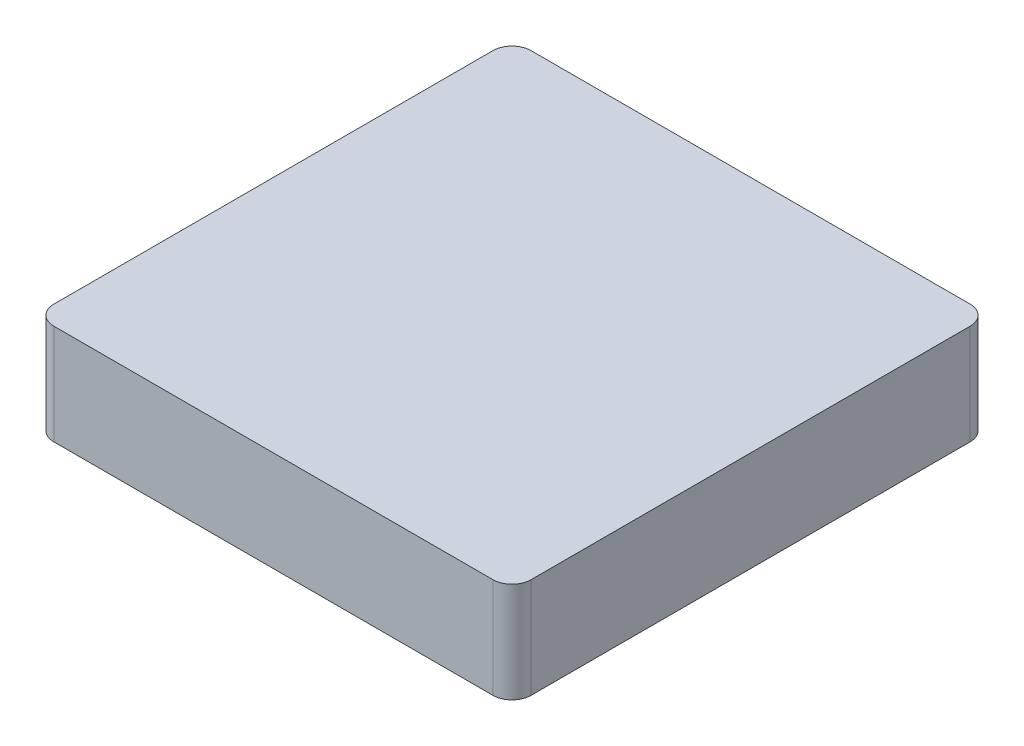
ISO-10303-21;
HEADER;
FILE_DESCRIPTION(('STEP AP214'),'2;1');
FILE_NAME('part.step','',(''),(''),'','','');
FILE_SCHEMA(('AUTOMOTIVE_DESIGN { 1 0 10303 214 1 1 1 1 }'));
ENDSEC;
DATA;
#1=APPLICATION_CONTEXT('core data for automotive mechanical design processes');
#2=APPLICATION_PROTOCOL_DEFINITION('international standard','automotive_design',2000,#1);
#3=PRODUCT_CONTEXT('',#1,'mechanical');
#4=PRODUCT('Part','Part','',(#3));
#5=PRODUCT_RELATED_PRODUCT_CATEGORY('part','',(#4));
#6=PRODUCT_DEFINITION_FORMATION('','',#4);
#7=PRODUCT_DEFINITION_CONTEXT('part definition',#1,'design');
#8=PRODUCT_DEFINITION('design','',#6,#7);
#9=PRODUCT_DEFINITION_SHAPE('','',#8);
#10=(LENGTH_UNIT() NAMED_UNIT(*) SI_UNIT(.MILLI.,.METRE.));
#11=(NAMED_UNIT(*) PLANE_ANGLE_UNIT() SI_UNIT($,.RADIAN.));
#12=(NAMED_UNIT(*) SI_UNIT($,.STERADIAN.) SOLID_ANGLE_UNIT());
#13=UNCERTAINTY_MEASURE_WITH_UNIT(LENGTH_MEASURE(1.E-05),#10,'distance_accuracy_value','');
#14=(GEOMETRIC_REPRESENTATION_CONTEXT(3) GLOBAL_UNCERTAINTY_ASSIGNED_CONTEXT((#13)) GLOBAL_UNIT_ASSIGNED_CONTEXT((#10,
#11,#12)) REPRESENTATION_CONTEXT('',''));
#15=CARTESIAN_POINT('',(0.,0.,0.));
#16=DIRECTION('',(0.,0.,1.));
#17=DIRECTION('',(1.,0.,0.));
#18=AXIS2_PLACEMENT_3D('',#15,#16,#17);
#19=CARTESIAN_POINT('',(25.,10.,-25.));
#20=DIRECTION('',(-1.,0.,0.));
#21=DIRECTION('',(0.,0.,1.));
#22=AXIS2_PLACEMENT_3D('',#19,#20,#21);
#23=PLANE('',#22);
#24=DIRECTION('',(0.,0.,-1.));
#25=VECTOR('',#24,1.);
#26=CARTESIAN_POINT('',(25.,0.,-25.));
#27=LINE('',#26,#25);
#28=CARTESIAN_POINT('',(25.,0.,23.));
#29=VERTEX_POINT('',#28);
#30=CARTESIAN_POINT('',(25.,0.,-23.));
#31=VERTEX_POINT('',#30);
#32=EDGE_CURVE('E133',#29,#31,#27,.T.);
#33=ORIENTED_EDGE('',*,*,#32,.T.);
#34=DIRECTION('',(0.,-1.,0.));
#35=VECTOR('',#34,1.);
#36=CARTESIAN_POINT('',(25.,10.,-23.));
#37=LINE('',#36,#35);
#38=CARTESIAN_POINT('',(25.,10.5,-23.));
#39=VERTEX_POINT('',#38);
#40=EDGE_CURVE('E111',#31,#39,#37,.F.);
#41=ORIENTED_EDGE('',*,*,#40,.T.);
#42=DIRECTION('',(0.,0.,-1.));
#43=VECTOR('',#42,1.);
#44=CARTESIAN_POINT('',(25.,10.5,-25.));
#45=LINE('',#44,#43);
#46=CARTESIAN_POINT('',(25.,10.5,23.));
#47=VERTEX_POINT('',#46);
#48=EDGE_CURVE('E179',#47,#39,#45,.T.);
#49=ORIENTED_EDGE('',*,*,#48,.F.);
#50=DIRECTION('',(0.,-1.,0.));
#51=VECTOR('',#50,1.);
#52=CARTESIAN_POINT('',(25.,10.,23.));
#53=LINE('',#52,#51);
#54=EDGE_CURVE('E116',#47,#29,#53,.T.);
#55=ORIENTED_EDGE('',*,*,#54,.T.);
#56=EDGE_LOOP('',(#33,#41,#49,#55));
#57=FACE_BOUND('',#56,.T.);
#58=ADVANCED_FACE('F40',(#57),#23,.F.);
#59=CARTESIAN_POINT('',(-25.,10.,-25.));
#60=DIRECTION('',(0.,0.,1.));
#61=DIRECTION('',(1.,0.,0.));
#62=AXIS2_PLACEMENT_3D('',#59,#60,#61);
#63=PLANE('',#62);
#64=DIRECTION('',(-1.,0.,0.));
#65=VECTOR('',#64,1.);
#66=CARTESIAN_POINT('',(-25.,10.5,-25.));
#67=LINE('',#66,#65);
#68=CARTESIAN_POINT('',(23.,10.5,-25.));
#69=VERTEX_POINT('',#68);
#70=CARTESIAN_POINT('',(-23.,10.5,-25.));
#71=VERTEX_POINT('',#70);
#72=EDGE_CURVE('E126',#69,#71,#67,.T.);
#73=ORIENTED_EDGE('',*,*,#72,.F.);
#74=DIRECTION('',(0.,-1.,0.));
#75=VECTOR('',#74,1.);
#76=CARTESIAN_POINT('',(23.,10.,-25.));
#77=LINE('',#76,#75);
#78=CARTESIAN_POINT('',(23.,0.,-25.));
#79=VERTEX_POINT('',#78);
#80=EDGE_CURVE('E110',#69,#79,#77,.T.);
#81=ORIENTED_EDGE('',*,*,#80,.T.);
#82=DIRECTION('',(-1.,0.,0.));
#83=VECTOR('',#82,1.);
#84=CARTESIAN_POINT('',(-25.,0.,-25.));
#85=LINE('',#84,#83);
#86=CARTESIAN_POINT('',(-23.,0.,-25.));
#87=VERTEX_POINT('',#86);
#88=EDGE_CURVE('E123',#79,#87,#85,.T.);
#89=ORIENTED_EDGE('',*,*,#88,.T.);
#90=DIRECTION('',(0.,-1.,0.));
#91=VECTOR('',#90,1.);
#92=CARTESIAN_POINT('',(-23.,10.,-25.));
#93=LINE('',#92,#91);
#94=EDGE_CURVE('E128',#87,#71,#93,.F.);
#95=ORIENTED_EDGE('',*,*,#94,.T.);
#96=EDGE_LOOP('',(#73,#81,#89,#95));
#97=FACE_BOUND('',#96,.T.);
#98=ADVANCED_FACE('F122',(#97),#63,.F.);
#99=CARTESIAN_POINT('',(-25.,10.,-25.));
#100=DIRECTION('',(1.,0.,0.));
#101=DIRECTION('',(0.,0.,-1.));
#102=AXIS2_PLACEMENT_3D('',#99,#100,#101);
#103=PLANE('',#102);
#104=DIRECTION('',(0.,0.,1.));
#105=VECTOR('',#104,1.);
#106=CARTESIAN_POINT('',(-25.,0.,-25.));
#107=LINE('',#106,#105);
#108=CARTESIAN_POINT('',(-25.,0.,-23.));
#109=VERTEX_POINT('',#108);
#110=CARTESIAN_POINT('',(-25.,0.,23.));
#111=VERTEX_POINT('',#110);
#112=EDGE_CURVE('E132',#109,#111,#107,.T.);
#113=ORIENTED_EDGE('',*,*,#112,.T.);
#114=DIRECTION('',(0.,-1.,0.));
#115=VECTOR('',#114,1.);
#116=CARTESIAN_POINT('',(-25.,10.,23.));
#117=LINE('',#116,#115);
#118=CARTESIAN_POINT('',(-25.,10.5,23.));
#119=VERTEX_POINT('',#118);
#120=EDGE_CURVE('E11',#111,#119,#117,.F.);
#121=ORIENTED_EDGE('',*,*,#120,.T.);
#122=DIRECTION('',(0.,0.,1.));
#123=VECTOR('',#122,1.);
#124=CARTESIAN_POINT('',(-25.,10.5,-25.));
#125=LINE('',#124,#123);
#126=CARTESIAN_POINT('',(-25.,10.5,-23.));
#127=VERTEX_POINT('',#126);
#128=EDGE_CURVE('E167',#127,#119,#125,.T.);
#129=ORIENTED_EDGE('',*,*,#128,.F.);
#130=DIRECTION('',(0.,-1.,0.));
#131=VECTOR('',#130,1.);
#132=CARTESIAN_POINT('',(-25.,10.,-23.));
#133=LINE('',#132,#131);
#134=EDGE_CURVE('E48',#127,#109,#133,.T.);
#135=ORIENTED_EDGE('',*,*,#134,.T.);
#136=EDGE_LOOP('',(#113,#121,#129,#135));
#137=FACE_BOUND('',#136,.T.);
#138=ADVANCED_FACE('F165',(#137),#103,.F.);
#139=CARTESIAN_POINT('',(-25.,10.,25.));
#140=DIRECTION('',(0.,0.,-1.));
#141=DIRECTION('',(-1.,0.,0.));
#142=AXIS2_PLACEMENT_3D('',#139,#140,#141);
#143=PLANE('',#142);
#144=DIRECTION('',(1.,0.,0.));
#145=VECTOR('',#144,1.);
#146=CARTESIAN_POINT('',(-25.,0.,25.));
#147=LINE('',#146,#145);
#148=CARTESIAN_POINT('',(-23.,0.,25.));
#149=VERTEX_POINT('',#148);
#150=CARTESIAN_POINT('',(23.,0.,25.));
#151=VERTEX_POINT('',#150);
#152=EDGE_CURVE('E136',#149,#151,#147,.T.);
#153=ORIENTED_EDGE('',*,*,#152,.T.);
#154=DIRECTION('',(0.,-1.,0.));
#155=VECTOR('',#154,1.);
#156=CARTESIAN_POINT('',(23.,10.,25.));
#157=LINE('',#156,#155);
#158=CARTESIAN_POINT('',(23.,10.5,25.));
#159=VERTEX_POINT('',#158);
#160=EDGE_CURVE('E55',#151,#159,#157,.F.);
#161=ORIENTED_EDGE('',*,*,#160,.T.);
#162=DIRECTION('',(1.,0.,0.));
#163=VECTOR('',#162,1.);
#164=CARTESIAN_POINT('',(-25.,10.5,25.));
#165=LINE('',#164,#163);
#166=CARTESIAN_POINT('',(-23.,10.5,25.));
#167=VERTEX_POINT('',#166);
#168=EDGE_CURVE('E138',#167,#159,#165,.T.);
#169=ORIENTED_EDGE('',*,*,#168,.F.);
#170=DIRECTION('',(0.,-1.,0.));
#171=VECTOR('',#170,1.);
#172=CARTESIAN_POINT('',(-23.,10.,25.));
#173=LINE('',#172,#171);
#174=EDGE_CURVE('E158',#167,#149,#173,.T.);
#175=ORIENTED_EDGE('',*,*,#174,.T.);
#176=EDGE_LOOP('',(#153,#161,#169,#175));
#177=FACE_BOUND('',#176,.T.);
#178=ADVANCED_FACE('F174',(#177),#143,.F.);
#179=CARTESIAN_POINT('',(0.,0.,0.));
#180=DIRECTION('',(0.,1.,0.));
#181=DIRECTION('',(0.,0.,1.));
#182=AXIS2_PLACEMENT_3D('',#179,#180,#181);
#183=PLANE('',#182);
#184=ORIENTED_EDGE('',*,*,#88,.F.);
#185=CARTESIAN_POINT('',(23.,0.,-23.));
#186=DIRECTION('',(0.,1.,0.));
#187=DIRECTION('',(0.,0.,1.));
#188=AXIS2_PLACEMENT_3D('',#185,#186,#187);
#189=CIRCLE('',#188,2.);
#190=EDGE_CURVE('E106',#79,#31,#189,.F.);
#191=ORIENTED_EDGE('',*,*,#190,.T.);
#192=ORIENTED_EDGE('',*,*,#32,.F.);
#193=CARTESIAN_POINT('',(23.,0.,23.));
#194=DIRECTION('',(0.,1.,0.));
#195=DIRECTION('',(0.,0.,1.));
#196=AXIS2_PLACEMENT_3D('',#193,#194,#195);
#197=CIRCLE('',#196,2.);
#198=EDGE_CURVE('E117',#29,#151,#197,.F.);
#199=ORIENTED_EDGE('',*,*,#198,.T.);
#200=ORIENTED_EDGE('',*,*,#152,.F.);
#201=CARTESIAN_POINT('',(-23.,0.,23.));
#202=DIRECTION('',(0.,1.,0.));
#203=DIRECTION('',(0.,0.,1.));
#204=AXIS2_PLACEMENT_3D('',#201,#202,#203);
#205=CIRCLE('',#204,2.);
#206=EDGE_CURVE('E145',#149,#111,#205,.F.);
#207=ORIENTED_EDGE('',*,*,#206,.T.);
#208=ORIENTED_EDGE('',*,*,#112,.F.);
#209=CARTESIAN_POINT('',(-23.,0.,-23.));
#210=DIRECTION('',(0.,1.,0.));
#211=DIRECTION('',(0.,0.,1.));
#212=AXIS2_PLACEMENT_3D('',#209,#210,#211);
#213=CIRCLE('',#212,2.);
#214=EDGE_CURVE('E127',#109,#87,#213,.F.);
#215=ORIENTED_EDGE('',*,*,#214,.T.);
#216=EDGE_LOOP('',(#184,#191,#192,#199,#200,#207,#208,#215));
#217=FACE_BOUND('',#216,.T.);
#218=ADVANCED_FACE('F130',(#217),#183,.F.);
#219=CARTESIAN_POINT('',(0.,10.5,0.));
#220=DIRECTION('',(0.,1.,0.));
#221=DIRECTION('',(0.,0.,1.));
#222=AXIS2_PLACEMENT_3D('',#219,#220,#221);
#223=PLANE('',#222);
#224=ORIENTED_EDGE('',*,*,#48,.T.);
#225=CARTESIAN_POINT('',(23.,10.5,-23.));
#226=DIRECTION('',(0.,1.,0.));
#227=DIRECTION('',(0.,0.,1.));
#228=AXIS2_PLACEMENT_3D('',#225,#226,#227);
#229=CIRCLE('',#228,2.);
#230=EDGE_CURVE('E156',#39,#69,#229,.T.);
#231=ORIENTED_EDGE('',*,*,#230,.T.);
#232=ORIENTED_EDGE('',*,*,#72,.T.);
#233=CARTESIAN_POINT('',(-23.,10.5,-23.));
#234=DIRECTION('',(0.,1.,0.));
#235=DIRECTION('',(0.,0.,1.));
#236=AXIS2_PLACEMENT_3D('',#233,#234,#235);
#237=CIRCLE('',#236,2.);
#238=EDGE_CURVE('E151',#71,#127,#237,.T.);
#239=ORIENTED_EDGE('',*,*,#238,.T.);
#240=ORIENTED_EDGE('',*,*,#128,.T.);
#241=CARTESIAN_POINT('',(-23.,10.5,23.));
#242=DIRECTION('',(0.,1.,0.));
#243=DIRECTION('',(0.,0.,1.));
#244=AXIS2_PLACEMENT_3D('',#241,#242,#243);
#245=CIRCLE('',#244,2.);
#246=EDGE_CURVE('E62',#119,#167,#245,.T.);
#247=ORIENTED_EDGE('',*,*,#246,.T.);
#248=ORIENTED_EDGE('',*,*,#168,.T.);
#249=CARTESIAN_POINT('',(23.,10.5,23.));
#250=DIRECTION('',(0.,1.,0.));
#251=DIRECTION('',(0.,0.,1.));
#252=AXIS2_PLACEMENT_3D('',#249,#250,#251);
#253=CIRCLE('',#252,2.);
#254=EDGE_CURVE('E154',#159,#47,#253,.T.);
#255=ORIENTED_EDGE('',*,*,#254,.T.);
#256=EDGE_LOOP('',(#224,#231,#232,#239,#240,#247,#248,#255));
#257=FACE_BOUND('',#256,.T.);
#258=ADVANCED_FACE('F182',(#257),#223,.T.);
#259=CARTESIAN_POINT('',(23.,10.,-23.));
#260=DIRECTION('',(0.,-1.,0.));
#261=DIRECTION('',(0.,0.,-1.));
#262=AXIS2_PLACEMENT_3D('',#259,#260,#261);
#263=CYLINDRICAL_SURFACE('',#262,2.);
#264=ORIENTED_EDGE('',*,*,#230,.F.);
#265=ORIENTED_EDGE('',*,*,#40,.F.);
#266=ORIENTED_EDGE('',*,*,#190,.F.);
#267=ORIENTED_EDGE('',*,*,#80,.F.);
#268=EDGE_LOOP('',(#264,#265,#266,#267));
#269=FACE_BOUND('',#268,.T.);
#270=ADVANCED_FACE('F109',(#269),#263,.T.);
#271=CARTESIAN_POINT('',(23.,10.,23.));
#272=DIRECTION('',(0.,-1.,0.));
#273=DIRECTION('',(0.,0.,-1.));
#274=AXIS2_PLACEMENT_3D('',#271,#272,#273);
#275=CYLINDRICAL_SURFACE('',#274,2.);
#276=ORIENTED_EDGE('',*,*,#254,.F.);
#277=ORIENTED_EDGE('',*,*,#160,.F.);
#278=ORIENTED_EDGE('',*,*,#198,.F.);
#279=ORIENTED_EDGE('',*,*,#54,.F.);
#280=EDGE_LOOP('',(#276,#277,#278,#279));
#281=FACE_BOUND('',#280,.T.);
#282=ADVANCED_FACE('F186',(#281),#275,.T.);
#283=CARTESIAN_POINT('',(-23.,10.,23.));
#284=DIRECTION('',(0.,-1.,0.));
#285=DIRECTION('',(0.,0.,-1.));
#286=AXIS2_PLACEMENT_3D('',#283,#284,#285);
#287=CYLINDRICAL_SURFACE('',#286,2.);
#288=ORIENTED_EDGE('',*,*,#246,.F.);
#289=ORIENTED_EDGE('',*,*,#120,.F.);
#290=ORIENTED_EDGE('',*,*,#206,.F.);
#291=ORIENTED_EDGE('',*,*,#174,.F.);
#292=EDGE_LOOP('',(#288,#289,#290,#291));
#293=FACE_BOUND('',#292,.T.);
#294=ADVANCED_FACE('F173',(#293),#287,.T.);
#295=CARTESIAN_POINT('',(-23.,10.,-23.));
#296=DIRECTION('',(0.,-1.,0.));
#297=DIRECTION('',(0.,0.,-1.));
#298=AXIS2_PLACEMENT_3D('',#295,#296,#297);
#299=CYLINDRICAL_SURFACE('',#298,2.);
#300=ORIENTED_EDGE('',*,*,#238,.F.);
#301=ORIENTED_EDGE('',*,*,#94,.F.);
#302=ORIENTED_EDGE('',*,*,#214,.F.);
#303=ORIENTED_EDGE('',*,*,#134,.F.);
#304=EDGE_LOOP('',(#300,#301,#302,#303));
#305=FACE_BOUND('',#304,.T.);
#306=ADVANCED_FACE('F42',(#305),#299,.T.);
#307=CLOSED_SHELL('',(#58,#98,#138,#178,#218,#258,#270,#282,#294,#306));
#308=MANIFOLD_SOLID_BREP('B2',#307);
#309=ADVANCED_BREP_SHAPE_REPRESENTATION('',(#18,#308),#14);
#310=SHAPE_DEFINITION_REPRESENTATION(#9,#309);
ENDSEC;
END-ISO-10303-21;
